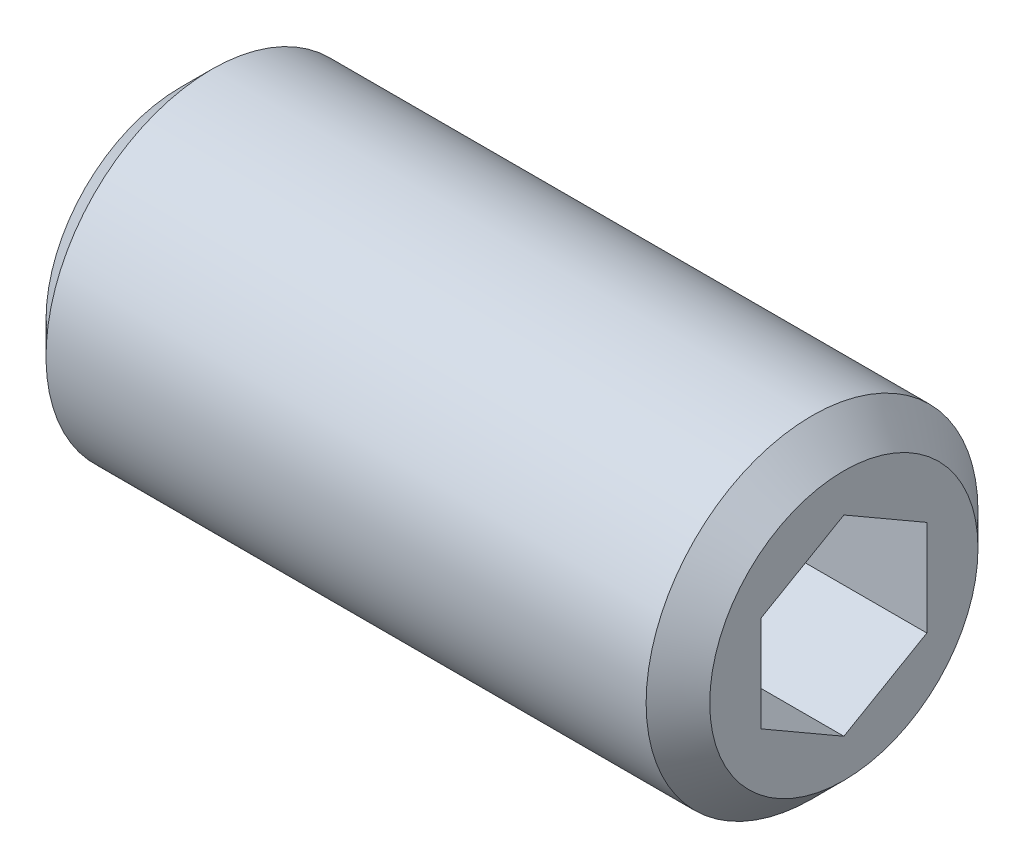
ISO-10303-21;
HEADER;
FILE_DESCRIPTION(('STEP AP214'),'2;1');
FILE_NAME('part.step','',(''),(''),'','','');
FILE_SCHEMA(('AUTOMOTIVE_DESIGN { 1 0 10303 214 1 1 1 1 }'));
ENDSEC;
DATA;
#1=APPLICATION_CONTEXT('core data for automotive mechanical design processes');
#2=APPLICATION_PROTOCOL_DEFINITION('international standard','automotive_design',2000,#1);
#3=PRODUCT_CONTEXT('',#1,'mechanical');
#4=PRODUCT('Part','Part','',(#3));
#5=PRODUCT_RELATED_PRODUCT_CATEGORY('part','',(#4));
#6=PRODUCT_DEFINITION_FORMATION('','',#4);
#7=PRODUCT_DEFINITION_CONTEXT('part definition',#1,'design');
#8=PRODUCT_DEFINITION('design','',#6,#7);
#9=PRODUCT_DEFINITION_SHAPE('','',#8);
#10=(LENGTH_UNIT() NAMED_UNIT(*) SI_UNIT(.MILLI.,.METRE.));
#11=(NAMED_UNIT(*) PLANE_ANGLE_UNIT() SI_UNIT($,.RADIAN.));
#12=(NAMED_UNIT(*) SI_UNIT($,.STERADIAN.) SOLID_ANGLE_UNIT());
#13=UNCERTAINTY_MEASURE_WITH_UNIT(LENGTH_MEASURE(1.E-05),#10,'distance_accuracy_value','');
#14=(GEOMETRIC_REPRESENTATION_CONTEXT(3) GLOBAL_UNCERTAINTY_ASSIGNED_CONTEXT((#13)) GLOBAL_UNIT_ASSIGNED_CONTEXT((#10,
#11,#12)) REPRESENTATION_CONTEXT('',''));
#15=CARTESIAN_POINT('',(0.,0.,0.));
#16=DIRECTION('',(0.,0.,1.));
#17=DIRECTION('',(1.,0.,0.));
#18=AXIS2_PLACEMENT_3D('',#15,#16,#17);
#19=CARTESIAN_POINT('',(11.0080000013113,0.,0.));
#20=DIRECTION('',(1.,0.,0.));
#21=DIRECTION('',(0.,0.,-1.));
#22=AXIS2_PLACEMENT_3D('',#19,#20,#21);
#23=CONICAL_SURFACE('',#22,2.32325748214634,1.04719754985041);
#24=CARTESIAN_POINT('',(9.66666666477067,-1.70530256582424E-10,0.));
#25=VERTEX_POINT('',#24);
#26=VERTEX_LOOP('',#25);
#27=FACE_BOUND('',#26,.T.);
#28=CARTESIAN_POINT('',(11.0000000015463,-1.15470053890749,1.99999999978952));
#29=CARTESIAN_POINT('',(10.970695546729,-1.20544263427257,1.91211211208328));
#30=CARTESIAN_POINT('',(10.9440446786853,-1.25662273479194,1.82346557746206));
#31=CARTESIAN_POINT('',(10.8975263889011,-1.35986908513588,1.64463765283451));
#32=CARTESIAN_POINT('',(10.877675421772,-1.41193716885137,1.55445308643649));
#33=CARTESIAN_POINT('',(10.8467759602991,-1.5154280825947,1.37520156574686));
#34=CARTESIAN_POINT('',(10.8355217889338,-1.56683499367993,1.28616218387419));
#35=CARTESIAN_POINT('',(10.822089169462,-1.66989057616154,1.10766467900308));
#36=CARTESIAN_POINT('',(10.8198995953163,-1.72153887323591,1.01820720434936));
#37=CARTESIAN_POINT('',(10.8244662915442,-1.81803817557173,0.851065509810939));
#38=CARTESIAN_POINT('',(10.8301012866309,-1.8629036613402,0.773356208952951));
#39=CARTESIAN_POINT('',(10.8479573021892,-1.95234234887103,0.618443857986715));
#40=CARTESIAN_POINT('',(10.8601844162709,-1.99691524151975,0.541241343279018));
#41=CARTESIAN_POINT('',(10.8907498349095,-2.08653818118143,0.386009858261453));
#42=CARTESIAN_POINT('',(10.9092176438278,-2.13157689092394,0.308000524680035));
#43=CARTESIAN_POINT('',(10.9511317625293,-2.22098275233646,0.153145030219006));
#44=CARTESIAN_POINT('',(10.9745682304842,-2.26535104851535,0.0762968869918664));
#45=CARTESIAN_POINT('',(11.0000000017753,-2.30940107653259,3.91234845948038E-10));
#46=B_SPLINE_CURVE_WITH_KNOTS('',3,(#28,#29,#30,#31,#32,#33,#34,#35,#36,#37,#38,#39,#40,#41,#42,
#43,#44,#45),.UNSPECIFIED.,.F.,.F.,(4,2,2,2,2,2,2,2,4),(0.,0.317016011624381,0.634793817174247,
0.944707606342016,1.25424088912324,1.52370778259738,1.79342419350259,2.06912162195613,
2.34427797273706),.UNSPECIFIED.);
#47=CARTESIAN_POINT('',(11.0000000017592,-1.15470053825233,1.99999999978011));
#48=VERTEX_POINT('',#47);
#49=CARTESIAN_POINT('',(11.0000000018325,-2.30940107663154,2.19849960238795E-10));
#50=VERTEX_POINT('',#49);
#51=EDGE_CURVE('E19',#48,#50,#46,.T.);
#52=ORIENTED_EDGE('',*,*,#51,.T.);
#53=CARTESIAN_POINT('',(11.0000000015463,-2.30940107684033,-5.62723461490458E-10));
#54=CARTESIAN_POINT('',(10.970695546729,-2.25865898108431,-0.0878878880432485));
#55=CARTESIAN_POINT('',(10.9440446786853,-2.20747888040456,-0.176534422571881));
#56=CARTESIAN_POINT('',(10.8975263889011,-2.10423252994303,-0.355362347131533));
#57=CARTESIAN_POINT('',(10.877675421772,-2.05216444627081,-0.44554691355454));
#58=CARTESIAN_POINT('',(10.8467759602991,-1.94867353255825,-0.624798434261942));
#59=CARTESIAN_POINT('',(10.8355217889338,-1.89726662146188,-0.713837816128169));
#60=CARTESIAN_POINT('',(10.822089169462,-1.79421103897216,-0.892335320994605));
#61=CARTESIAN_POINT('',(10.8198995953163,-1.74256274190082,-0.981792795650074));
#62=CARTESIAN_POINT('',(10.8244662915442,-1.64606343956689,-1.14893449018958));
#63=CARTESIAN_POINT('',(10.8301012866309,-1.60119795379777,-1.2266437910472));
#64=CARTESIAN_POINT('',(10.8479573021892,-1.51175926626646,-1.38155614201315));
#65=CARTESIAN_POINT('',(10.8601844162709,-1.46718637361791,-1.45875865672094));
#66=CARTESIAN_POINT('',(10.8907498349095,-1.37756343395636,-1.61399014173858));
#67=CARTESIAN_POINT('',(10.9092176438278,-1.33252472421382,-1.69199947531997));
#68=CARTESIAN_POINT('',(10.9511317625293,-1.24311886280122,-1.84685496978096));
#69=CARTESIAN_POINT('',(10.9745682304842,-1.1987505666223,-1.92370311300807));
#70=CARTESIAN_POINT('',(11.0000000017753,-1.15470053860512,-1.99999999960874));
#71=B_SPLINE_CURVE_WITH_KNOTS('',3,(#53,#54,#55,#56,#57,#58,#59,#60,#61,#62,#63,#64,#65,#66,#67,
#68,#69,#70),.UNSPECIFIED.,.F.,.F.,(4,2,2,2,2,2,2,2,4),(0.,0.317016011624382,0.634793817174249,
0.944707606342019,1.25424088912325,1.52370778259737,1.79342419350258,2.06912162195611,
2.34427797273704),.UNSPECIFIED.);
#72=CARTESIAN_POINT('',(11.0000000018325,-1.15470053850617,-1.99999999978013));
#73=VERTEX_POINT('',#72);
#74=EDGE_CURVE('E109',#50,#73,#71,.T.);
#75=ORIENTED_EDGE('',*,*,#74,.T.);
#76=CARTESIAN_POINT('',(11.0000000015463,-1.15470053793283,-2.00000000035222));
#77=CARTESIAN_POINT('',(10.970695546729,-1.05321634681174,-2.00000000012652));
#78=CARTESIAN_POINT('',(10.9440446786853,-0.950856145612615,-2.00000000003393));
#79=CARTESIAN_POINT('',(10.8975263889011,-0.744363444807143,-1.99999999996604));
#80=CARTESIAN_POINT('',(10.877675421772,-0.640227277419423,-1.99999999999103));
#81=CARTESIAN_POINT('',(10.8467759602991,-0.433245449963544,-2.0000000000088));
#82=CARTESIAN_POINT('',(10.8355217889338,-0.330431627781939,-2.00000000000236));
#83=CARTESIAN_POINT('',(10.822089169462,-0.12432046281061,-1.99999999999769));
#84=CARTESIAN_POINT('',(10.8198995953163,-0.0210238686649022,-1.99999999999944));
#85=CARTESIAN_POINT('',(10.8244662915442,0.17197473600486,-2.00000000000053));
#86=CARTESIAN_POINT('',(10.830101286631,0.261705707542435,-2.00000000000016));
#87=CARTESIAN_POINT('',(10.8479573021892,0.440583082604577,-1.99999999999989));
#88=CARTESIAN_POINT('',(10.860184416271,0.529728867901839,-1.99999999999998));
#89=CARTESIAN_POINT('',(10.8907498349096,0.708974747225071,-2.00000000000006));
#90=CARTESIAN_POINT('',(10.9092176438279,0.799052166710125,-2.00000000000004));
#91=CARTESIAN_POINT('',(10.9511317625294,0.977863889535231,-2.));
#92=CARTESIAN_POINT('',(10.9745682304842,1.06660048189304,-1.99999999999998));
#93=CARTESIAN_POINT('',(11.0000000017754,1.15470053792747,-2.00000000000002));
#94=B_SPLINE_CURVE_WITH_KNOTS('',3,(#76,#77,#78,#79,#80,#81,#82,#83,#84,#85,#86,#87,#88,#89,#90,
#91,#92,#93),.UNSPECIFIED.,.F.,.F.,(4,2,2,2,2,2,2,2,4),(0.,0.317016011624382,0.63479381717425,
0.944707606342019,1.25424088912325,1.52370778259737,1.79342419350258,2.06912162195611,
2.34427797273703),.UNSPECIFIED.);
#95=CARTESIAN_POINT('',(11.0000000018325,1.15470053812537,-2.));
#96=VERTEX_POINT('',#95);
#97=EDGE_CURVE('E105',#73,#96,#94,.T.);
#98=ORIENTED_EDGE('',*,*,#97,.T.);
#99=CARTESIAN_POINT('',(11.0000000015463,1.15470053890749,-1.99999999978952));
#100=CARTESIAN_POINT('',(10.970695546729,1.20544263427257,-1.91211211208328));
#101=CARTESIAN_POINT('',(10.9440446786854,1.25662273479194,-1.82346557746205));
#102=CARTESIAN_POINT('',(10.8975263889011,1.35986908513588,-1.64463765283451));
#103=CARTESIAN_POINT('',(10.877675421772,1.41193716885138,-1.55445308643649));
#104=CARTESIAN_POINT('',(10.8467759602991,1.5154280825947,-1.37520156574686));
#105=CARTESIAN_POINT('',(10.8355217889338,1.56683499367993,-1.28616218387419));
#106=CARTESIAN_POINT('',(10.822089169462,1.66989057616154,-1.10766467900308));
#107=CARTESIAN_POINT('',(10.8198995953163,1.72153887323591,-1.01820720434936));
#108=CARTESIAN_POINT('',(10.8244662915442,1.81803817557174,-0.851065509810937));
#109=CARTESIAN_POINT('',(10.8301012866309,1.8629036613402,-0.773356208952951));
#110=CARTESIAN_POINT('',(10.8479573021892,1.95234234887103,-0.618443857986719));
#111=CARTESIAN_POINT('',(10.8601844162709,1.99691524151975,-0.541241343279024));
#112=CARTESIAN_POINT('',(10.8907498349095,2.08653818118143,-0.386009858261463));
#113=CARTESIAN_POINT('',(10.9092176438278,2.13157689092394,-0.308000524680047));
#114=CARTESIAN_POINT('',(10.9511317625293,2.22098275233645,-0.153145030219021));
#115=CARTESIAN_POINT('',(10.9745682304842,2.26535104851534,-0.0762968869918836));
#116=CARTESIAN_POINT('',(11.0000000017753,2.30940107653259,-3.91254547009403E-10));
#117=B_SPLINE_CURVE_WITH_KNOTS('',3,(#99,#100,#101,#102,#103,#104,#105,#106,#107,#108,#109,#110,
#111,#112,#113,#114,#115,#116),.UNSPECIFIED.,.F.,.F.,(4,2,2,2,2,2,2,2,4),(0.,0.317016011624383,
0.63479381717425,0.94470760634202,1.25424088912325,1.52370778259737,1.79342419350258,
2.06912162195611,2.34427797273704),.UNSPECIFIED.);
#118=CARTESIAN_POINT('',(11.0000000018325,2.30940107663155,-2.19877675805291E-10));
#119=VERTEX_POINT('',#118);
#120=EDGE_CURVE('E101',#96,#119,#117,.T.);
#121=ORIENTED_EDGE('',*,*,#120,.T.);
#122=CARTESIAN_POINT('',(11.0000000015463,2.30940107684033,5.62698290783199E-10));
#123=CARTESIAN_POINT('',(10.9706955467291,2.25865898108432,0.0878878880432257));
#124=CARTESIAN_POINT('',(10.9440446786854,2.20747888040457,0.17653442257186));
#125=CARTESIAN_POINT('',(10.8975263889011,2.10423252994304,0.355362347131512));
#126=CARTESIAN_POINT('',(10.877675421772,2.05216444627082,0.44554691355452));
#127=CARTESIAN_POINT('',(10.8467759602991,1.94867353255826,0.624798434261922));
#128=CARTESIAN_POINT('',(10.8355217889338,1.89726662146189,0.71383781612815));
#129=CARTESIAN_POINT('',(10.822089169462,1.79421103897217,0.892335320994587));
#130=CARTESIAN_POINT('',(10.8198995953163,1.74256274190083,0.981792795650056));
#131=CARTESIAN_POINT('',(10.8244662915442,1.64606343956689,1.14893449018957));
#132=CARTESIAN_POINT('',(10.8301012866309,1.60119795379778,1.22664379104718));
#133=CARTESIAN_POINT('',(10.8479573021892,1.51175926626646,1.38155614201314));
#134=CARTESIAN_POINT('',(10.8601844162709,1.46718637361791,1.45875865672093));
#135=CARTESIAN_POINT('',(10.8907498349095,1.37756343395636,1.61399014173857));
#136=CARTESIAN_POINT('',(10.9092176438278,1.33252472421381,1.69199947531997));
#137=CARTESIAN_POINT('',(10.9511317625293,1.24311886280122,1.84685496978096));
#138=CARTESIAN_POINT('',(10.9745682304842,1.19875056662229,1.92370311300807));
#139=CARTESIAN_POINT('',(11.0000000017753,1.15470053860511,1.99999999960874));
#140=B_SPLINE_CURVE_WITH_KNOTS('',3,(#122,#123,#124,#125,#126,#127,#128,#129,#130,#131,#132,
#133,#134,#135,#136,#137,#138,#139),.UNSPECIFIED.,.F.,.F.,(4,2,2,2,2,2,2,2,4),(0.,
0.317016011624385,0.634793817174255,0.944707606342027,1.25424088912326,1.52370778259739,
1.7934241935026,2.06912162195614,2.34427797273707),.UNSPECIFIED.);
#141=CARTESIAN_POINT('',(11.0000000018325,1.15470053850616,1.99999999978013));
#142=VERTEX_POINT('',#141);
#143=EDGE_CURVE('E84',#119,#142,#140,.T.);
#144=ORIENTED_EDGE('',*,*,#143,.T.);
#145=CARTESIAN_POINT('',(11.0000000015463,1.15470053793282,2.00000000035222));
#146=CARTESIAN_POINT('',(10.970695546729,1.05321634681174,2.00000000012652));
#147=CARTESIAN_POINT('',(10.9440446786853,0.950856145612608,2.00000000003393));
#148=CARTESIAN_POINT('',(10.8975263889011,0.744363444807138,1.99999999996604));
#149=CARTESIAN_POINT('',(10.877675421772,0.640227277419417,1.99999999999103));
#150=CARTESIAN_POINT('',(10.8467759602991,0.433245449963538,2.0000000000088));
#151=CARTESIAN_POINT('',(10.8355217889338,0.330431627781933,2.00000000000236));
#152=CARTESIAN_POINT('',(10.822089169462,0.124320462810605,1.99999999999769));
#153=CARTESIAN_POINT('',(10.8198995953163,0.0210238686648968,1.99999999999944));
#154=CARTESIAN_POINT('',(10.8244662915442,-0.171974736004865,2.00000000000053));
#155=CARTESIAN_POINT('',(10.830101286631,-0.261705707542441,2.00000000000016));
#156=CARTESIAN_POINT('',(10.8479573021892,-0.440583082604583,1.99999999999989));
#157=CARTESIAN_POINT('',(10.860184416271,-0.529728867901845,1.99999999999998));
#158=CARTESIAN_POINT('',(10.8907498349096,-0.708974747225078,2.00000000000006));
#159=CARTESIAN_POINT('',(10.9092176438279,-0.799052166710132,2.00000000000004));
#160=CARTESIAN_POINT('',(10.9511317625294,-0.977863889535238,2.));
#161=CARTESIAN_POINT('',(10.9745682304842,-1.06660048189305,1.99999999999998));
#162=CARTESIAN_POINT('',(11.0000000017754,-1.15470053792748,2.00000000000002));
#163=B_SPLINE_CURVE_WITH_KNOTS('',3,(#145,#146,#147,#148,#149,#150,#151,#152,#153,#154,#155,
#156,#157,#158,#159,#160,#161,#162),.UNSPECIFIED.,.F.,.F.,(4,2,2,2,2,2,2,2,4),(0.,
0.317016011624382,0.634793817174248,0.944707606342018,1.25424088912325,1.52370778259737,
1.79342419350258,2.06912162195611,2.34427797273703),.UNSPECIFIED.);
#164=EDGE_CURVE('E82',#142,#48,#163,.T.);
#165=ORIENTED_EDGE('',*,*,#164,.T.);
#166=EDGE_LOOP('',(#52,#75,#98,#121,#144,#165));
#167=FACE_BOUND('',#166,.T.);
#168=ADVANCED_FACE('F15',(#27,#167),#23,.F.);
#169=CARTESIAN_POINT('',(16.,-1.15470053837929,1.99999999999997));
#170=DIRECTION('',(0.,-0.866025403784449,0.499999999999983));
#171=DIRECTION('',(0.,-0.499999999999983,-0.866025403784449));
#172=AXIS2_PLACEMENT_3D('',#169,#170,#171);
#173=PLANE('',#172);
#174=DIRECTION('',(1.,0.,0.));
#175=VECTOR('',#174,1.);
#176=CARTESIAN_POINT('',(16.,-1.15470053837929,2.00000000000002));
#177=LINE('',#176,#175);
#178=CARTESIAN_POINT('',(16.,-1.15470053837929,2.00000000000002));
#179=VERTEX_POINT('',#178);
#180=EDGE_CURVE('E75',#48,#179,#177,.T.);
#181=ORIENTED_EDGE('',*,*,#180,.T.);
#182=DIRECTION('',(0.,-0.499999999999983,-0.866025403784449));
#183=VECTOR('',#182,1.);
#184=CARTESIAN_POINT('',(16.,-1.15470053837929,1.99999999999997));
#185=LINE('',#184,#183);
#186=CARTESIAN_POINT('',(16.,-2.3094010767585,0.));
#187=VERTEX_POINT('',#186);
#188=EDGE_CURVE('E86',#179,#187,#185,.T.);
#189=ORIENTED_EDGE('',*,*,#188,.T.);
#190=DIRECTION('',(1.,0.,0.));
#191=VECTOR('',#190,1.);
#192=CARTESIAN_POINT('',(16.,-2.3094010767585,0.));
#193=LINE('',#192,#191);
#194=EDGE_CURVE('E78',#187,#50,#193,.F.);
#195=ORIENTED_EDGE('',*,*,#194,.T.);
#196=ORIENTED_EDGE('',*,*,#51,.F.);
#197=EDGE_LOOP('',(#181,#189,#195,#196));
#198=FACE_BOUND('',#197,.T.);
#199=ADVANCED_FACE('F73',(#198),#173,.F.);
#200=CARTESIAN_POINT('',(16.,-2.3094010767585,0.));
#201=DIRECTION('',(0.,-0.866025403784429,-0.500000000000017));
#202=DIRECTION('',(0.,0.500000000000017,-0.866025403784429));
#203=AXIS2_PLACEMENT_3D('',#200,#201,#202);
#204=PLANE('',#203);
#205=ORIENTED_EDGE('',*,*,#194,.F.);
#206=DIRECTION('',(0.,0.500000000000017,-0.866025403784429));
#207=VECTOR('',#206,1.);
#208=CARTESIAN_POINT('',(16.,-2.3094010767585,0.));
#209=LINE('',#208,#207);
#210=CARTESIAN_POINT('',(16.,-1.15470053837921,-2.00000000000002));
#211=VERTEX_POINT('',#210);
#212=EDGE_CURVE('E116',#187,#211,#209,.T.);
#213=ORIENTED_EDGE('',*,*,#212,.T.);
#214=DIRECTION('',(-1.,0.,0.));
#215=VECTOR('',#214,1.);
#216=CARTESIAN_POINT('',(16.,-1.15470053837921,-2.00000000000002));
#217=LINE('',#216,#215);
#218=EDGE_CURVE('E106',#211,#73,#217,.T.);
#219=ORIENTED_EDGE('',*,*,#218,.T.);
#220=ORIENTED_EDGE('',*,*,#74,.F.);
#221=EDGE_LOOP('',(#205,#213,#219,#220));
#222=FACE_BOUND('',#221,.T.);
#223=ADVANCED_FACE('F161',(#222),#204,.F.);
#224=CARTESIAN_POINT('',(16.,-1.15470053837921,-2.00000000000002));
#225=DIRECTION('',(0.,0.,-1.));
#226=DIRECTION('',(-1.,0.,0.));
#227=AXIS2_PLACEMENT_3D('',#224,#225,#226);
#228=PLANE('',#227);
#229=ORIENTED_EDGE('',*,*,#218,.F.);
#230=DIRECTION('',(0.,1.,0.));
#231=VECTOR('',#230,1.);
#232=CARTESIAN_POINT('',(16.,0.,-2.00000000000002));
#233=LINE('',#232,#231);
#234=CARTESIAN_POINT('',(16.,1.15470053837928,-1.99999999999999));
#235=VERTEX_POINT('',#234);
#236=EDGE_CURVE('E118',#211,#235,#233,.T.);
#237=ORIENTED_EDGE('',*,*,#236,.T.);
#238=DIRECTION('',(1.,0.,0.));
#239=VECTOR('',#238,1.);
#240=CARTESIAN_POINT('',(16.,1.15470053837929,-1.99999999999998));
#241=LINE('',#240,#239);
#242=EDGE_CURVE('E102',#235,#96,#241,.F.);
#243=ORIENTED_EDGE('',*,*,#242,.T.);
#244=ORIENTED_EDGE('',*,*,#97,.F.);
#245=EDGE_LOOP('',(#229,#237,#243,#244));
#246=FACE_BOUND('',#245,.T.);
#247=ADVANCED_FACE('F147',(#246),#228,.F.);
#248=CARTESIAN_POINT('',(16.,1.15470053837929,-1.99999999999998));
#249=DIRECTION('',(0.,0.866025403784449,-0.499999999999983));
#250=DIRECTION('',(0.,0.499999999999983,0.866025403784449));
#251=AXIS2_PLACEMENT_3D('',#248,#249,#250);
#252=PLANE('',#251);
#253=ORIENTED_EDGE('',*,*,#242,.F.);
#254=DIRECTION('',(0.,0.49999999999999,0.866025403784445));
#255=VECTOR('',#254,1.);
#256=CARTESIAN_POINT('',(16.,1.15470053837929,-1.99999999999998));
#257=LINE('',#256,#255);
#258=CARTESIAN_POINT('',(16.,2.30940107675851,0.));
#259=VERTEX_POINT('',#258);
#260=EDGE_CURVE('E112',#235,#259,#257,.T.);
#261=ORIENTED_EDGE('',*,*,#260,.T.);
#262=DIRECTION('',(1.,0.,0.));
#263=VECTOR('',#262,1.);
#264=CARTESIAN_POINT('',(16.,2.30940107675852,0.));
#265=LINE('',#264,#263);
#266=EDGE_CURVE('E95',#259,#119,#265,.F.);
#267=ORIENTED_EDGE('',*,*,#266,.T.);
#268=ORIENTED_EDGE('',*,*,#120,.F.);
#269=EDGE_LOOP('',(#253,#261,#267,#268));
#270=FACE_BOUND('',#269,.T.);
#271=ADVANCED_FACE('F143',(#270),#252,.F.);
#272=CARTESIAN_POINT('',(16.,2.3094010767585,0.));
#273=DIRECTION('',(0.,0.866025403784428,0.500000000000019));
#274=DIRECTION('',(0.,-0.500000000000019,0.866025403784428));
#275=AXIS2_PLACEMENT_3D('',#272,#273,#274);
#276=PLANE('',#275);
#277=ORIENTED_EDGE('',*,*,#266,.F.);
#278=DIRECTION('',(0.,-0.500000000000009,0.866025403784433));
#279=VECTOR('',#278,1.);
#280=CARTESIAN_POINT('',(16.,2.3094010767585,0.));
#281=LINE('',#280,#279);
#282=CARTESIAN_POINT('',(16.,1.15470053837921,2.00000000000002));
#283=VERTEX_POINT('',#282);
#284=EDGE_CURVE('E37',#259,#283,#281,.T.);
#285=ORIENTED_EDGE('',*,*,#284,.T.);
#286=DIRECTION('',(1.,0.,0.));
#287=VECTOR('',#286,1.);
#288=CARTESIAN_POINT('',(16.,1.15470053837921,2.00000000000002));
#289=LINE('',#288,#287);
#290=EDGE_CURVE('E87',#283,#142,#289,.F.);
#291=ORIENTED_EDGE('',*,*,#290,.T.);
#292=ORIENTED_EDGE('',*,*,#143,.F.);
#293=EDGE_LOOP('',(#277,#285,#291,#292));
#294=FACE_BOUND('',#293,.T.);
#295=ADVANCED_FACE('F138',(#294),#276,.F.);
#296=CARTESIAN_POINT('',(16.,1.15470053837921,2.00000000000002));
#297=DIRECTION('',(0.,0.,1.));
#298=DIRECTION('',(1.,0.,0.));
#299=AXIS2_PLACEMENT_3D('',#296,#297,#298);
#300=PLANE('',#299);
#301=ORIENTED_EDGE('',*,*,#290,.F.);
#302=DIRECTION('',(0.,1.,0.));
#303=VECTOR('',#302,1.);
#304=CARTESIAN_POINT('',(16.,0.,2.00000000000002));
#305=LINE('',#304,#303);
#306=EDGE_CURVE('E91',#283,#179,#305,.F.);
#307=ORIENTED_EDGE('',*,*,#306,.T.);
#308=ORIENTED_EDGE('',*,*,#180,.F.);
#309=ORIENTED_EDGE('',*,*,#164,.F.);
#310=EDGE_LOOP('',(#301,#307,#308,#309));
#311=FACE_BOUND('',#310,.T.);
#312=ADVANCED_FACE('F89',(#311),#300,.F.);
#313=CARTESIAN_POINT('',(16.,0.,0.));
#314=DIRECTION('',(-1.,0.,0.));
#315=DIRECTION('',(0.,0.,1.));
#316=AXIS2_PLACEMENT_3D('',#313,#314,#315);
#317=PLANE('',#316);
#318=ORIENTED_EDGE('',*,*,#284,.F.);
#319=ORIENTED_EDGE('',*,*,#260,.F.);
#320=ORIENTED_EDGE('',*,*,#236,.F.);
#321=ORIENTED_EDGE('',*,*,#212,.F.);
#322=ORIENTED_EDGE('',*,*,#188,.F.);
#323=ORIENTED_EDGE('',*,*,#306,.F.);
#324=EDGE_LOOP('',(#318,#319,#320,#321,#322,#323));
#325=FACE_BOUND('',#324,.T.);
#326=CARTESIAN_POINT('',(16.0000000003038,0.,0.));
#327=DIRECTION('',(-1.,0.,0.));
#328=DIRECTION('',(0.,0.,1.));
#329=AXIS2_PLACEMENT_3D('',#326,#327,#328);
#330=CIRCLE('',#329,3.23318750037061);
#331=CARTESIAN_POINT('',(16.0000000003038,0.,3.23318750037061));
#332=VERTEX_POINT('',#331);
#333=EDGE_CURVE('E114',#332,#332,#330,.T.);
#334=ORIENTED_EDGE('',*,*,#333,.F.);
#335=EDGE_LOOP('',(#334));
#336=FACE_BOUND('',#335,.T.);
#337=ADVANCED_FACE('F137',(#325,#336),#317,.F.);
#338=CARTESIAN_POINT('',(0.,2.,0.));
#339=DIRECTION('',(-1.,0.,0.));
#340=DIRECTION('',(0.,0.,1.));
#341=AXIS2_PLACEMENT_3D('',#338,#339,#340);
#342=PLANE('',#341);
#343=CARTESIAN_POINT('',(-2.84217311144475E-10,0.,0.));
#344=DIRECTION('',(1.,0.,0.));
#345=DIRECTION('',(0.,1.,0.));
#346=AXIS2_PLACEMENT_3D('',#343,#344,#345);
#347=CIRCLE('',#346,3.23318750031376);
#348=CARTESIAN_POINT('',(-2.84217530233782E-10,3.23318750031376,0.));
#349=VERTEX_POINT('',#348);
#350=EDGE_CURVE('E121',#349,#349,#347,.T.);
#351=ORIENTED_EDGE('',*,*,#350,.F.);
#352=EDGE_LOOP('',(#351));
#353=FACE_BOUND('',#352,.T.);
#354=ADVANCED_FACE('F186',(#353),#342,.T.);
#355=CARTESIAN_POINT('',(15.2331874997458,0.,0.));
#356=DIRECTION('',(-1.,0.,0.));
#357=DIRECTION('',(0.,0.,1.));
#358=AXIS2_PLACEMENT_3D('',#355,#356,#357);
#359=CONICAL_SURFACE('',#358,3.99999999950751,0.78539816247083);
#360=ORIENTED_EDGE('',*,*,#333,.T.);
#361=EDGE_LOOP('',(#360));
#362=FACE_BOUND('',#361,.T.);
#363=CARTESIAN_POINT('',(15.2331875,0.,0.));
#364=DIRECTION('',(1.,0.,0.));
#365=DIRECTION('',(0.,1.,0.));
#366=AXIS2_PLACEMENT_3D('',#363,#364,#365);
#367=CIRCLE('',#366,4.);
#368=CARTESIAN_POINT('',(15.2331875,4.,0.));
#369=VERTEX_POINT('',#368);
#370=EDGE_CURVE('E28',#369,#369,#367,.F.);
#371=ORIENTED_EDGE('',*,*,#370,.F.);
#372=EDGE_LOOP('',(#371));
#373=FACE_BOUND('',#372,.T.);
#374=ADVANCED_FACE('F180',(#362,#373),#359,.T.);
#375=CARTESIAN_POINT('',(0.766812500330616,0.,0.));
#376=DIRECTION('',(1.,0.,0.));
#377=DIRECTION('',(0.,1.,0.));
#378=AXIS2_PLACEMENT_3D('',#375,#376,#377);
#379=CONICAL_SURFACE('',#378,3.9999999996212,0.785398162544959);
#380=CARTESIAN_POINT('',(0.7668125,0.,0.));
#381=DIRECTION('',(1.,0.,0.));
#382=DIRECTION('',(0.,1.,0.));
#383=AXIS2_PLACEMENT_3D('',#380,#381,#382);
#384=CIRCLE('',#383,4.);
#385=CARTESIAN_POINT('',(0.7668125,4.,0.));
#386=VERTEX_POINT('',#385);
#387=EDGE_CURVE('E10',#386,#386,#384,.T.);
#388=ORIENTED_EDGE('',*,*,#387,.F.);
#389=EDGE_LOOP('',(#388));
#390=FACE_BOUND('',#389,.T.);
#391=ORIENTED_EDGE('',*,*,#350,.T.);
#392=EDGE_LOOP('',(#391));
#393=FACE_BOUND('',#392,.T.);
#394=ADVANCED_FACE('F174',(#390,#393),#379,.T.);
#395=CARTESIAN_POINT('',(8.,0.,0.));
#396=DIRECTION('',(1.,0.,0.));
#397=DIRECTION('',(0.,1.,0.));
#398=AXIS2_PLACEMENT_3D('',#395,#396,#397);
#399=CYLINDRICAL_SURFACE('',#398,4.);
#400=ORIENTED_EDGE('',*,*,#387,.T.);
#401=EDGE_LOOP('',(#400));
#402=FACE_BOUND('',#401,.T.);
#403=ORIENTED_EDGE('',*,*,#370,.T.);
#404=EDGE_LOOP('',(#403));
#405=FACE_BOUND('',#404,.T.);
#406=ADVANCED_FACE('F172',(#402,#405),#399,.T.);
#407=CLOSED_SHELL('',(#168,#199,#223,#247,#271,#295,#312,#337,#354,#374,#394,#406));
#408=MANIFOLD_SOLID_BREP('B1',#407);
#409=ADVANCED_BREP_SHAPE_REPRESENTATION('',(#18,#408),#14);
#410=SHAPE_DEFINITION_REPRESENTATION(#9,#409);
ENDSEC;
END-ISO-10303-21;
